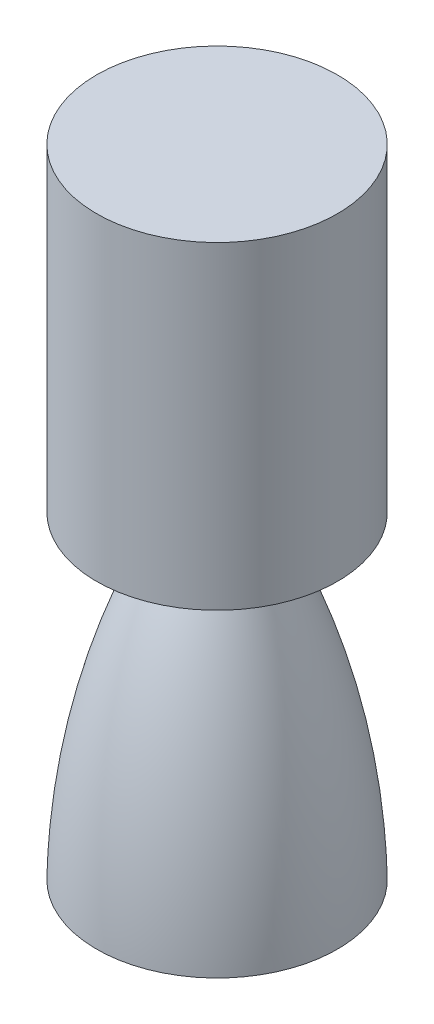
ISO-10303-21;
HEADER;
FILE_DESCRIPTION(('STEP AP214'),'2;1');
FILE_NAME('part.step','',(''),(''),'','','');
FILE_SCHEMA(('AUTOMOTIVE_DESIGN { 1 0 10303 214 1 1 1 1 }'));
ENDSEC;
DATA;
#1=APPLICATION_CONTEXT('core data for automotive mechanical design processes');
#2=APPLICATION_PROTOCOL_DEFINITION('international standard','automotive_design',2000,#1);
#3=PRODUCT_CONTEXT('',#1,'mechanical');
#4=PRODUCT('Part','Part','',(#3));
#5=PRODUCT_RELATED_PRODUCT_CATEGORY('part','',(#4));
#6=PRODUCT_DEFINITION_FORMATION('','',#4);
#7=PRODUCT_DEFINITION_CONTEXT('part definition',#1,'design');
#8=PRODUCT_DEFINITION('design','',#6,#7);
#9=PRODUCT_DEFINITION_SHAPE('','',#8);
#10=(LENGTH_UNIT() NAMED_UNIT(*) SI_UNIT(.MILLI.,.METRE.));
#11=(NAMED_UNIT(*) PLANE_ANGLE_UNIT() SI_UNIT($,.RADIAN.));
#12=(NAMED_UNIT(*) SI_UNIT($,.STERADIAN.) SOLID_ANGLE_UNIT());
#13=UNCERTAINTY_MEASURE_WITH_UNIT(LENGTH_MEASURE(1.E-05),#10,'distance_accuracy_value','');
#14=(GEOMETRIC_REPRESENTATION_CONTEXT(3) GLOBAL_UNCERTAINTY_ASSIGNED_CONTEXT((#13)) GLOBAL_UNIT_ASSIGNED_CONTEXT((#10,
#11,#12)) REPRESENTATION_CONTEXT('',''));
#15=CARTESIAN_POINT('',(0.,0.,0.));
#16=DIRECTION('',(0.,0.,1.));
#17=DIRECTION('',(1.,0.,0.));
#18=AXIS2_PLACEMENT_3D('',#15,#16,#17);
#19=CARTESIAN_POINT('',(-8.0353335281131E-13,-1.8427451703223E-13,0.));
#20=DIRECTION('',(0.,1.,0.));
#21=DIRECTION('',(-1.,0.,0.));
#22=AXIS2_PLACEMENT_3D('',#19,#20,#21);
#23=PLANE('',#22);
#24=CARTESIAN_POINT('',(-8.0353335281131E-13,-1.8427451703223E-13,0.));
#25=DIRECTION('',(0.,1.,0.));
#26=DIRECTION('',(-1.,0.,0.));
#27=AXIS2_PLACEMENT_3D('',#24,#25,#26);
#28=CIRCLE('',#27,77.4699999999992);
#29=CARTESIAN_POINT('',(-77.47,0.,0.));
#30=VERTEX_POINT('',#29);
#31=EDGE_CURVE('E73',#30,#30,#28,.T.);
#32=ORIENTED_EDGE('',*,*,#31,.F.);
#33=EDGE_LOOP('',(#32));
#34=FACE_BOUND('',#33,.T.);
#35=ADVANCED_FACE('F39',(#34),#23,.F.);
#36=CARTESIAN_POINT('',(-8.32667268468867E-13,-8.98855671820868,0.));
#37=DIRECTION('',(0.,1.,0.));
#38=DIRECTION('',(-1.,0.,0.));
#39=AXIS2_PLACEMENT_3D('',#36,#37,#38);
#40=DEGENERATE_TOROIDAL_SURFACE('',#39,387.405918398025,464.962808897962,.F.);
#41=CARTESIAN_POINT('',(-4.01766676405655E-13,204.978,0.));
#42=DIRECTION('',(0.,1.,0.));
#43=DIRECTION('',(-1.,0.,0.));
#44=AXIS2_PLACEMENT_3D('',#41,#42,#43);
#45=CIRCLE('',#44,25.3999999999995);
#46=CARTESIAN_POINT('',(-25.3999999999999,204.978,0.));
#47=VERTEX_POINT('',#46);
#48=EDGE_CURVE('E56',#47,#47,#45,.T.);
#49=ORIENTED_EDGE('',*,*,#48,.F.);
#50=EDGE_LOOP('',(#49));
#51=FACE_BOUND('',#50,.T.);
#52=ORIENTED_EDGE('',*,*,#31,.T.);
#53=EDGE_LOOP('',(#52));
#54=FACE_BOUND('',#53,.T.);
#55=ADVANCED_FACE('F79',(#51,#54),#40,.F.);
#56=CARTESIAN_POINT('',(-25.3999999999999,204.978,0.));
#57=DIRECTION('',(0.,1.,0.));
#58=DIRECTION('',(-1.,0.,0.));
#59=AXIS2_PLACEMENT_3D('',#56,#57,#58);
#60=PLANE('',#59);
#61=CARTESIAN_POINT('',(-4.01766676405655E-13,204.978,0.));
#62=DIRECTION('',(0.,1.,0.));
#63=DIRECTION('',(-1.,0.,0.));
#64=AXIS2_PLACEMENT_3D('',#61,#62,#63);
#65=CIRCLE('',#64,77.4699999999996);
#66=CARTESIAN_POINT('',(-77.47,204.978,0.));
#67=VERTEX_POINT('',#66);
#68=EDGE_CURVE('E65',#67,#67,#65,.T.);
#69=ORIENTED_EDGE('',*,*,#68,.F.);
#70=EDGE_LOOP('',(#69));
#71=FACE_BOUND('',#70,.T.);
#72=ORIENTED_EDGE('',*,*,#48,.T.);
#73=EDGE_LOOP('',(#72));
#74=FACE_BOUND('',#73,.T.);
#75=ADVANCED_FACE('F86',(#71,#74),#60,.F.);
#76=CARTESIAN_POINT('',(-8.0353335281131E-13,0.,0.));
#77=DIRECTION('',(0.,1.,0.));
#78=DIRECTION('',(-1.,0.,0.));
#79=AXIS2_PLACEMENT_3D('',#76,#77,#78);
#80=CYLINDRICAL_SURFACE('',#79,77.4699999999998);
#81=CARTESIAN_POINT('',(0.,409.956,0.));
#82=DIRECTION('',(0.,1.,0.));
#83=DIRECTION('',(-1.,0.,0.));
#84=AXIS2_PLACEMENT_3D('',#81,#82,#83);
#85=CIRCLE('',#84,77.47);
#86=CARTESIAN_POINT('',(-77.47,409.956,0.));
#87=VERTEX_POINT('',#86);
#88=EDGE_CURVE('E69',#87,#87,#85,.T.);
#89=ORIENTED_EDGE('',*,*,#88,.F.);
#90=EDGE_LOOP('',(#89));
#91=FACE_BOUND('',#90,.T.);
#92=ORIENTED_EDGE('',*,*,#68,.T.);
#93=EDGE_LOOP('',(#92));
#94=FACE_BOUND('',#93,.T.);
#95=ADVANCED_FACE('F92',(#91,#94),#80,.T.);
#96=CARTESIAN_POINT('',(-77.47,409.956,0.));
#97=DIRECTION('',(0.,-1.,0.));
#98=DIRECTION('',(1.,0.,0.));
#99=AXIS2_PLACEMENT_3D('',#96,#97,#98);
#100=PLANE('',#99);
#101=ORIENTED_EDGE('',*,*,#88,.T.);
#102=EDGE_LOOP('',(#101));
#103=FACE_BOUND('',#102,.T.);
#104=ADVANCED_FACE('F90',(#103),#100,.F.);
#105=CLOSED_SHELL('',(#35,#55,#75,#95,#104));
#106=CARTESIAN_POINT('',(-7.98554831418428E-13,2.53999999999982,0.));
#107=DIRECTION('',(0.,1.,0.));
#108=DIRECTION('',(-1.,0.,0.));
#109=AXIS2_PLACEMENT_3D('',#106,#107,#108);
#110=PLANE('',#109);
#111=CARTESIAN_POINT('',(-8.10070746322936E-13,2.53999999999981,0.));
#112=DIRECTION('',(0.,1.,0.));
#113=DIRECTION('',(-1.,0.,0.));
#114=AXIS2_PLACEMENT_3D('',#111,#112,#113);
#115=CIRCLE('',#114,74.8731602645035);
#116=CARTESIAN_POINT('',(-74.8731602645043,2.53999999999996,0.));
#117=VERTEX_POINT('',#116);
#118=EDGE_CURVE('E43',#117,#117,#115,.T.);
#119=ORIENTED_EDGE('',*,*,#118,.T.);
#120=EDGE_LOOP('',(#119));
#121=FACE_BOUND('',#120,.T.);
#122=ADVANCED_FACE('F154',(#121),#110,.T.);
#123=CARTESIAN_POINT('',(-8.32667268468867E-13,-8.98855671820868,0.));
#124=DIRECTION('',(0.,1.,0.));
#125=DIRECTION('',(-1.,0.,0.));
#126=AXIS2_PLACEMENT_3D('',#123,#124,#125);
#127=DEGENERATE_TOROIDAL_SURFACE('',#126,387.405918398025,462.422808897962,.F.);
#128=CARTESIAN_POINT('',(-4.08304069917281E-13,207.518,0.));
#129=DIRECTION('',(0.,1.,0.));
#130=DIRECTION('',(-1.,0.,0.));
#131=AXIS2_PLACEMENT_3D('',#128,#129,#130);
#132=CIRCLE('',#131,21.201185171047);
#133=CARTESIAN_POINT('',(-21.2011851710474,207.518,0.));
#134=VERTEX_POINT('',#133);
#135=EDGE_CURVE('E53',#134,#134,#132,.T.);
#136=ORIENTED_EDGE('',*,*,#135,.T.);
#137=EDGE_LOOP('',(#136));
#138=FACE_BOUND('',#137,.T.);
#139=ORIENTED_EDGE('',*,*,#118,.F.);
#140=EDGE_LOOP('',(#139));
#141=FACE_BOUND('',#140,.T.);
#142=ADVANCED_FACE('F158',(#138,#141),#127,.T.);
#143=CARTESIAN_POINT('',(-25.3999999999999,207.518,0.));
#144=DIRECTION('',(0.,1.,0.));
#145=DIRECTION('',(-1.,0.,0.));
#146=AXIS2_PLACEMENT_3D('',#143,#144,#145);
#147=PLANE('',#146);
#148=CARTESIAN_POINT('',(-3.96788155012772E-13,207.518,0.));
#149=DIRECTION('',(0.,1.,0.));
#150=DIRECTION('',(-1.,0.,0.));
#151=AXIS2_PLACEMENT_3D('',#148,#149,#150);
#152=CIRCLE('',#151,74.9299999999998);
#153=CARTESIAN_POINT('',(-74.9300000000002,207.518,0.));
#154=VERTEX_POINT('',#153);
#155=EDGE_CURVE('E48',#154,#154,#152,.T.);
#156=ORIENTED_EDGE('',*,*,#155,.T.);
#157=EDGE_LOOP('',(#156));
#158=FACE_BOUND('',#157,.T.);
#159=ORIENTED_EDGE('',*,*,#135,.F.);
#160=EDGE_LOOP('',(#159));
#161=FACE_BOUND('',#160,.T.);
#162=ADVANCED_FACE('F167',(#158,#161),#147,.T.);
#163=CARTESIAN_POINT('',(-8.0353335281131E-13,0.,0.));
#164=DIRECTION('',(0.,1.,0.));
#165=DIRECTION('',(-1.,0.,0.));
#166=AXIS2_PLACEMENT_3D('',#163,#164,#165);
#167=CYLINDRICAL_SURFACE('',#166,74.9299999999998);
#168=CARTESIAN_POINT('',(0.,407.416,0.));
#169=DIRECTION('',(0.,-1.,0.));
#170=DIRECTION('',(1.,0.,0.));
#171=AXIS2_PLACEMENT_3D('',#168,#169,#170);
#172=CIRCLE('',#171,74.9299999999998);
#173=CARTESIAN_POINT('',(74.9299999999998,407.416,0.));
#174=VERTEX_POINT('',#173);
#175=EDGE_CURVE('E10',#174,#174,#172,.F.);
#176=ORIENTED_EDGE('',*,*,#175,.T.);
#177=EDGE_LOOP('',(#176));
#178=FACE_BOUND('',#177,.T.);
#179=ORIENTED_EDGE('',*,*,#155,.F.);
#180=EDGE_LOOP('',(#179));
#181=FACE_BOUND('',#180,.T.);
#182=ADVANCED_FACE('F177',(#178,#181),#167,.F.);
#183=CARTESIAN_POINT('',(-77.47,407.416,0.));
#184=DIRECTION('',(0.,-1.,0.));
#185=DIRECTION('',(1.,0.,0.));
#186=AXIS2_PLACEMENT_3D('',#183,#184,#185);
#187=PLANE('',#186);
#188=ORIENTED_EDGE('',*,*,#175,.F.);
#189=EDGE_LOOP('',(#188));
#190=FACE_BOUND('',#189,.T.);
#191=ADVANCED_FACE('F41',(#190),#187,.T.);
#192=CLOSED_SHELL('',(#122,#142,#162,#182,#191));
#193=ORIENTED_CLOSED_SHELL('',*,#192,.T.);
#194=BREP_WITH_VOIDS('B2',#105,(#193));
#195=ADVANCED_BREP_SHAPE_REPRESENTATION('',(#18,#194),#14);
#196=SHAPE_DEFINITION_REPRESENTATION(#9,#195);
ENDSEC;
END-ISO-10303-21;
